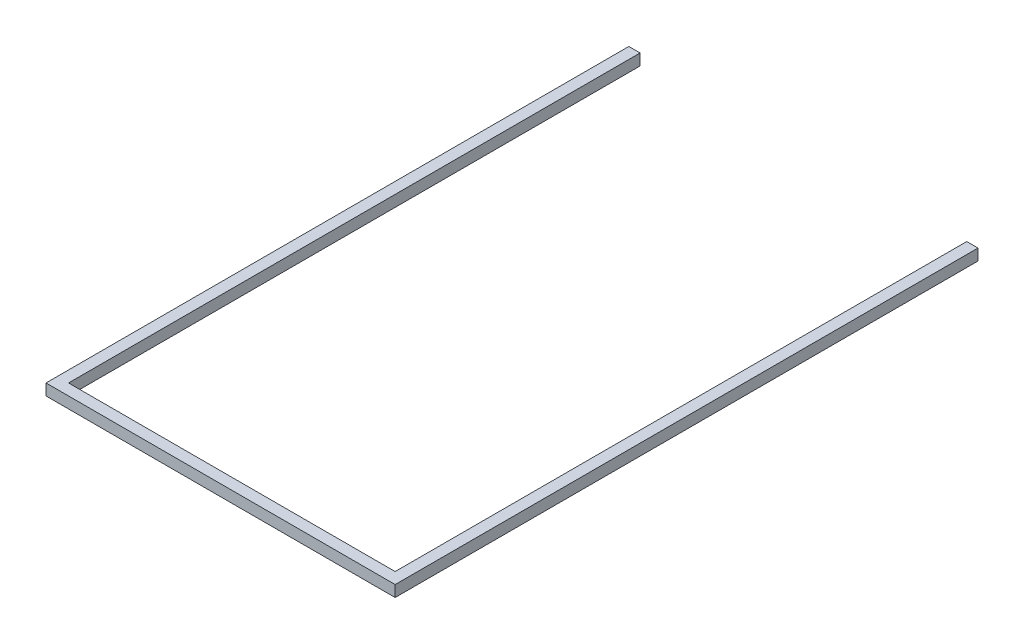
ISO-10303-21;
HEADER;
FILE_DESCRIPTION(('STEP AP214'),'2;1');
FILE_NAME('part.step','',(''),(''),'','','');
FILE_SCHEMA(('AUTOMOTIVE_DESIGN { 1 0 10303 214 1 1 1 1 }'));
ENDSEC;
DATA;
#1=APPLICATION_CONTEXT('core data for automotive mechanical design processes');
#2=APPLICATION_PROTOCOL_DEFINITION('international standard','automotive_design',2000,#1);
#3=PRODUCT_CONTEXT('',#1,'mechanical');
#4=PRODUCT('Part','Part','',(#3));
#5=PRODUCT_RELATED_PRODUCT_CATEGORY('part','',(#4));
#6=PRODUCT_DEFINITION_FORMATION('','',#4);
#7=PRODUCT_DEFINITION_CONTEXT('part definition',#1,'design');
#8=PRODUCT_DEFINITION('design','',#6,#7);
#9=PRODUCT_DEFINITION_SHAPE('','',#8);
#10=(LENGTH_UNIT() NAMED_UNIT(*) SI_UNIT(.MILLI.,.METRE.));
#11=(NAMED_UNIT(*) PLANE_ANGLE_UNIT() SI_UNIT($,.RADIAN.));
#12=(NAMED_UNIT(*) SI_UNIT($,.STERADIAN.) SOLID_ANGLE_UNIT());
#13=UNCERTAINTY_MEASURE_WITH_UNIT(LENGTH_MEASURE(1.E-05),#10,'distance_accuracy_value','');
#14=(GEOMETRIC_REPRESENTATION_CONTEXT(3) GLOBAL_UNCERTAINTY_ASSIGNED_CONTEXT((#13)) GLOBAL_UNIT_ASSIGNED_CONTEXT((#10,
#11,#12)) REPRESENTATION_CONTEXT('',''));
#15=CARTESIAN_POINT('',(0.,0.,0.));
#16=DIRECTION('',(0.,0.,1.));
#17=DIRECTION('',(1.,0.,0.));
#18=AXIS2_PLACEMENT_3D('',#15,#16,#17);
#19=CARTESIAN_POINT('',(-61.1442597325954,20.,-976.787813670094));
#20=DIRECTION('',(0.,0.,1.));
#21=DIRECTION('',(1.,0.,0.));
#22=AXIS2_PLACEMENT_3D('',#19,#20,#21);
#23=PLANE('',#22);
#24=DIRECTION('',(-1.,0.,0.));
#25=VECTOR('',#24,1.);
#26=CARTESIAN_POINT('',(-61.1442597325954,0.,-976.787813670094));
#27=LINE('',#26,#25);
#28=CARTESIAN_POINT('',(-61.1442597325954,0.,-976.787813670094));
#29=VERTEX_POINT('',#28);
#30=CARTESIAN_POINT('',(-81.1442597325955,0.,-976.787813670094));
#31=VERTEX_POINT('',#30);
#32=EDGE_CURVE('E129',#29,#31,#27,.T.);
#33=ORIENTED_EDGE('',*,*,#32,.T.);
#34=DIRECTION('',(0.,-1.,0.));
#35=VECTOR('',#34,1.);
#36=CARTESIAN_POINT('',(-81.1442597325955,20.,-976.787813670094));
#37=LINE('',#36,#35);
#38=CARTESIAN_POINT('',(-81.1442597325955,20.,-976.787813670094));
#39=VERTEX_POINT('',#38);
#40=EDGE_CURVE('E11',#39,#31,#37,.T.);
#41=ORIENTED_EDGE('',*,*,#40,.F.);
#42=DIRECTION('',(-1.,0.,0.));
#43=VECTOR('',#42,1.);
#44=CARTESIAN_POINT('',(-61.1442597325954,20.,-976.787813670094));
#45=LINE('',#44,#43);
#46=CARTESIAN_POINT('',(-61.1442597325954,20.,-976.787813670094));
#47=VERTEX_POINT('',#46);
#48=EDGE_CURVE('E143',#47,#39,#45,.T.);
#49=ORIENTED_EDGE('',*,*,#48,.F.);
#50=DIRECTION('',(0.,-1.,0.));
#51=VECTOR('',#50,1.);
#52=CARTESIAN_POINT('',(-61.1442597325954,20.,-976.787813670094));
#53=LINE('',#52,#51);
#54=EDGE_CURVE('E125',#47,#29,#53,.T.);
#55=ORIENTED_EDGE('',*,*,#54,.T.);
#56=EDGE_LOOP('',(#33,#41,#49,#55));
#57=FACE_BOUND('',#56,.T.);
#58=ADVANCED_FACE('F33',(#57),#23,.F.);
#59=CARTESIAN_POINT('',(-81.1442597325955,20.,-976.787813670094));
#60=DIRECTION('',(1.,0.,0.));
#61=DIRECTION('',(0.,0.,-1.));
#62=AXIS2_PLACEMENT_3D('',#59,#60,#61);
#63=PLANE('',#62);
#64=DIRECTION('',(0.,0.,1.));
#65=VECTOR('',#64,1.);
#66=CARTESIAN_POINT('',(-81.1442597325955,0.,-976.787813670094));
#67=LINE('',#66,#65);
#68=CARTESIAN_POINT('',(-81.1442597325954,0.,58.2121863299054));
#69=VERTEX_POINT('',#68);
#70=EDGE_CURVE('E132',#31,#69,#67,.T.);
#71=ORIENTED_EDGE('',*,*,#70,.T.);
#72=DIRECTION('',(0.,-1.,0.));
#73=VECTOR('',#72,1.);
#74=CARTESIAN_POINT('',(-81.1442597325954,20.,58.2121863299054));
#75=LINE('',#74,#73);
#76=CARTESIAN_POINT('',(-81.1442597325954,20.,58.2121863299054));
#77=VERTEX_POINT('',#76);
#78=EDGE_CURVE('E41',#77,#69,#75,.T.);
#79=ORIENTED_EDGE('',*,*,#78,.F.);
#80=DIRECTION('',(0.,0.,1.));
#81=VECTOR('',#80,1.);
#82=CARTESIAN_POINT('',(-81.1442597325955,20.,-976.787813670094));
#83=LINE('',#82,#81);
#84=EDGE_CURVE('E92',#39,#77,#83,.T.);
#85=ORIENTED_EDGE('',*,*,#84,.F.);
#86=ORIENTED_EDGE('',*,*,#40,.T.);
#87=EDGE_LOOP('',(#71,#79,#85,#86));
#88=FACE_BOUND('',#87,.T.);
#89=ADVANCED_FACE('F178',(#88),#63,.F.);
#90=CARTESIAN_POINT('',(-81.1442597325954,20.,58.2121863299054));
#91=DIRECTION('',(0.,0.,-1.));
#92=DIRECTION('',(-1.,0.,0.));
#93=AXIS2_PLACEMENT_3D('',#90,#91,#92);
#94=PLANE('',#93);
#95=DIRECTION('',(1.,0.,0.));
#96=VECTOR('',#95,1.);
#97=CARTESIAN_POINT('',(-81.1442597325954,0.,58.2121863299054));
#98=LINE('',#97,#96);
#99=CARTESIAN_POINT('',(538.855740267405,0.,58.2121863299054));
#100=VERTEX_POINT('',#99);
#101=EDGE_CURVE('E134',#69,#100,#98,.T.);
#102=ORIENTED_EDGE('',*,*,#101,.T.);
#103=DIRECTION('',(0.,-1.,0.));
#104=VECTOR('',#103,1.);
#105=CARTESIAN_POINT('',(538.855740267405,20.,58.2121863299054));
#106=LINE('',#105,#104);
#107=CARTESIAN_POINT('',(538.855740267405,20.,58.2121863299054));
#108=VERTEX_POINT('',#107);
#109=EDGE_CURVE('E150',#108,#100,#106,.T.);
#110=ORIENTED_EDGE('',*,*,#109,.F.);
#111=DIRECTION('',(1.,0.,0.));
#112=VECTOR('',#111,1.);
#113=CARTESIAN_POINT('',(-81.1442597325954,20.,58.2121863299054));
#114=LINE('',#113,#112);
#115=EDGE_CURVE('E158',#77,#108,#114,.T.);
#116=ORIENTED_EDGE('',*,*,#115,.F.);
#117=ORIENTED_EDGE('',*,*,#78,.T.);
#118=EDGE_LOOP('',(#102,#110,#116,#117));
#119=FACE_BOUND('',#118,.T.);
#120=ADVANCED_FACE('F156',(#119),#94,.F.);
#121=CARTESIAN_POINT('',(538.855740267405,20.,58.2121863299054));
#122=DIRECTION('',(-1.,0.,0.));
#123=DIRECTION('',(0.,0.,1.));
#124=AXIS2_PLACEMENT_3D('',#121,#122,#123);
#125=PLANE('',#124);
#126=DIRECTION('',(0.,0.,-1.));
#127=VECTOR('',#126,1.);
#128=CARTESIAN_POINT('',(538.855740267405,0.,58.2121863299054));
#129=LINE('',#128,#127);
#130=CARTESIAN_POINT('',(538.855740267405,0.,-976.787813670095));
#131=VERTEX_POINT('',#130);
#132=EDGE_CURVE('E136',#100,#131,#129,.T.);
#133=ORIENTED_EDGE('',*,*,#132,.T.);
#134=DIRECTION('',(0.,-1.,0.));
#135=VECTOR('',#134,1.);
#136=CARTESIAN_POINT('',(538.855740267405,20.,-976.787813670095));
#137=LINE('',#136,#135);
#138=CARTESIAN_POINT('',(538.855740267405,20.,-976.787813670095));
#139=VERTEX_POINT('',#138);
#140=EDGE_CURVE('E147',#139,#131,#137,.T.);
#141=ORIENTED_EDGE('',*,*,#140,.F.);
#142=DIRECTION('',(0.,0.,-1.));
#143=VECTOR('',#142,1.);
#144=CARTESIAN_POINT('',(538.855740267405,20.,58.2121863299054));
#145=LINE('',#144,#143);
#146=EDGE_CURVE('E170',#108,#139,#145,.T.);
#147=ORIENTED_EDGE('',*,*,#146,.F.);
#148=ORIENTED_EDGE('',*,*,#109,.T.);
#149=EDGE_LOOP('',(#133,#141,#147,#148));
#150=FACE_BOUND('',#149,.T.);
#151=ADVANCED_FACE('F166',(#150),#125,.F.);
#152=CARTESIAN_POINT('',(538.855740267405,20.,-976.787813670095));
#153=DIRECTION('',(0.,0.,1.));
#154=DIRECTION('',(1.,0.,0.));
#155=AXIS2_PLACEMENT_3D('',#152,#153,#154);
#156=PLANE('',#155);
#157=DIRECTION('',(-1.,0.,0.));
#158=VECTOR('',#157,1.);
#159=CARTESIAN_POINT('',(538.855740267405,0.,-976.787813670095));
#160=LINE('',#159,#158);
#161=CARTESIAN_POINT('',(518.855740267404,0.,-976.787813670095));
#162=VERTEX_POINT('',#161);
#163=EDGE_CURVE('E138',#131,#162,#160,.T.);
#164=ORIENTED_EDGE('',*,*,#163,.T.);
#165=DIRECTION('',(0.,-1.,0.));
#166=VECTOR('',#165,1.);
#167=CARTESIAN_POINT('',(518.855740267404,20.,-976.787813670095));
#168=LINE('',#167,#166);
#169=CARTESIAN_POINT('',(518.855740267404,20.,-976.787813670095));
#170=VERTEX_POINT('',#169);
#171=EDGE_CURVE('E120',#170,#162,#168,.T.);
#172=ORIENTED_EDGE('',*,*,#171,.F.);
#173=DIRECTION('',(-1.,0.,0.));
#174=VECTOR('',#173,1.);
#175=CARTESIAN_POINT('',(538.855740267405,20.,-976.787813670095));
#176=LINE('',#175,#174);
#177=EDGE_CURVE('E111',#139,#170,#176,.T.);
#178=ORIENTED_EDGE('',*,*,#177,.F.);
#179=ORIENTED_EDGE('',*,*,#140,.T.);
#180=EDGE_LOOP('',(#164,#172,#178,#179));
#181=FACE_BOUND('',#180,.T.);
#182=ADVANCED_FACE('F169',(#181),#156,.F.);
#183=CARTESIAN_POINT('',(518.855740267404,20.,-976.787813670095));
#184=DIRECTION('',(1.,0.,0.));
#185=DIRECTION('',(0.,0.,-1.));
#186=AXIS2_PLACEMENT_3D('',#183,#184,#185);
#187=PLANE('',#186);
#188=DIRECTION('',(0.,0.,1.));
#189=VECTOR('',#188,1.);
#190=CARTESIAN_POINT('',(518.855740267404,0.,-976.787813670095));
#191=LINE('',#190,#189);
#192=CARTESIAN_POINT('',(518.855740267405,0.,38.2121863299052));
#193=VERTEX_POINT('',#192);
#194=EDGE_CURVE('E119',#162,#193,#191,.T.);
#195=ORIENTED_EDGE('',*,*,#194,.T.);
#196=DIRECTION('',(0.,-1.,0.));
#197=VECTOR('',#196,1.);
#198=CARTESIAN_POINT('',(518.855740267405,20.,38.2121863299052));
#199=LINE('',#198,#197);
#200=CARTESIAN_POINT('',(518.855740267405,20.,38.2121863299052));
#201=VERTEX_POINT('',#200);
#202=EDGE_CURVE('E116',#201,#193,#199,.T.);
#203=ORIENTED_EDGE('',*,*,#202,.F.);
#204=DIRECTION('',(0.,0.,1.));
#205=VECTOR('',#204,1.);
#206=CARTESIAN_POINT('',(518.855740267404,20.,-976.787813670095));
#207=LINE('',#206,#205);
#208=EDGE_CURVE('E105',#170,#201,#207,.T.);
#209=ORIENTED_EDGE('',*,*,#208,.F.);
#210=ORIENTED_EDGE('',*,*,#171,.T.);
#211=EDGE_LOOP('',(#195,#203,#209,#210));
#212=FACE_BOUND('',#211,.T.);
#213=ADVANCED_FACE('F117',(#212),#187,.F.);
#214=CARTESIAN_POINT('',(518.855740267405,20.,38.2121863299052));
#215=DIRECTION('',(0.,0.,1.));
#216=DIRECTION('',(1.,0.,0.));
#217=AXIS2_PLACEMENT_3D('',#214,#215,#216);
#218=PLANE('',#217);
#219=DIRECTION('',(-1.,0.,0.));
#220=VECTOR('',#219,1.);
#221=CARTESIAN_POINT('',(518.855740267405,0.,38.2121863299052));
#222=LINE('',#221,#220);
#223=CARTESIAN_POINT('',(-61.1442597325954,0.,38.2121863299054));
#224=VERTEX_POINT('',#223);
#225=EDGE_CURVE('E78',#193,#224,#222,.T.);
#226=ORIENTED_EDGE('',*,*,#225,.T.);
#227=DIRECTION('',(0.,-1.,0.));
#228=VECTOR('',#227,1.);
#229=CARTESIAN_POINT('',(-61.1442597325954,20.,38.2121863299054));
#230=LINE('',#229,#228);
#231=CARTESIAN_POINT('',(-61.1442597325954,20.,38.2121863299054));
#232=VERTEX_POINT('',#231);
#233=EDGE_CURVE('E121',#232,#224,#230,.T.);
#234=ORIENTED_EDGE('',*,*,#233,.F.);
#235=DIRECTION('',(-1.,0.,0.));
#236=VECTOR('',#235,1.);
#237=CARTESIAN_POINT('',(518.855740267405,20.,38.2121863299052));
#238=LINE('',#237,#236);
#239=EDGE_CURVE('E109',#201,#232,#238,.T.);
#240=ORIENTED_EDGE('',*,*,#239,.F.);
#241=ORIENTED_EDGE('',*,*,#202,.T.);
#242=EDGE_LOOP('',(#226,#234,#240,#241));
#243=FACE_BOUND('',#242,.T.);
#244=ADVANCED_FACE('F123',(#243),#218,.F.);
#245=CARTESIAN_POINT('',(-61.1442597325954,20.,38.2121863299054));
#246=DIRECTION('',(-1.,0.,0.));
#247=DIRECTION('',(0.,0.,1.));
#248=AXIS2_PLACEMENT_3D('',#245,#246,#247);
#249=PLANE('',#248);
#250=DIRECTION('',(0.,0.,-1.));
#251=VECTOR('',#250,1.);
#252=CARTESIAN_POINT('',(-61.1442597325954,0.,38.2121863299054));
#253=LINE('',#252,#251);
#254=EDGE_CURVE('E84',#224,#29,#253,.T.);
#255=ORIENTED_EDGE('',*,*,#254,.T.);
#256=ORIENTED_EDGE('',*,*,#54,.F.);
#257=DIRECTION('',(0.,0.,-1.));
#258=VECTOR('',#257,1.);
#259=CARTESIAN_POINT('',(-61.1442597325954,20.,38.2121863299054));
#260=LINE('',#259,#258);
#261=EDGE_CURVE('E49',#232,#47,#260,.T.);
#262=ORIENTED_EDGE('',*,*,#261,.F.);
#263=ORIENTED_EDGE('',*,*,#233,.T.);
#264=EDGE_LOOP('',(#255,#256,#262,#263));
#265=FACE_BOUND('',#264,.T.);
#266=ADVANCED_FACE('F194',(#265),#249,.F.);
#267=CARTESIAN_POINT('',(0.,20.,0.));
#268=DIRECTION('',(0.,1.,0.));
#269=DIRECTION('',(0.,0.,1.));
#270=AXIS2_PLACEMENT_3D('',#267,#268,#269);
#271=PLANE('',#270);
#272=ORIENTED_EDGE('',*,*,#48,.T.);
#273=ORIENTED_EDGE('',*,*,#84,.T.);
#274=ORIENTED_EDGE('',*,*,#115,.T.);
#275=ORIENTED_EDGE('',*,*,#146,.T.);
#276=ORIENTED_EDGE('',*,*,#177,.T.);
#277=ORIENTED_EDGE('',*,*,#208,.T.);
#278=ORIENTED_EDGE('',*,*,#239,.T.);
#279=ORIENTED_EDGE('',*,*,#261,.T.);
#280=EDGE_LOOP('',(#272,#273,#274,#275,#276,#277,#278,#279));
#281=FACE_BOUND('',#280,.T.);
#282=ADVANCED_FACE('F107',(#281),#271,.T.);
#283=CARTESIAN_POINT('',(0.,0.,0.));
#284=DIRECTION('',(0.,1.,0.));
#285=DIRECTION('',(0.,0.,1.));
#286=AXIS2_PLACEMENT_3D('',#283,#284,#285);
#287=PLANE('',#286);
#288=ORIENTED_EDGE('',*,*,#32,.F.);
#289=ORIENTED_EDGE('',*,*,#254,.F.);
#290=ORIENTED_EDGE('',*,*,#225,.F.);
#291=ORIENTED_EDGE('',*,*,#194,.F.);
#292=ORIENTED_EDGE('',*,*,#163,.F.);
#293=ORIENTED_EDGE('',*,*,#132,.F.);
#294=ORIENTED_EDGE('',*,*,#101,.F.);
#295=ORIENTED_EDGE('',*,*,#70,.F.);
#296=EDGE_LOOP('',(#288,#289,#290,#291,#292,#293,#294,#295));
#297=FACE_BOUND('',#296,.T.);
#298=ADVANCED_FACE('F162',(#297),#287,.F.);
#299=CLOSED_SHELL('',(#58,#89,#120,#151,#182,#213,#244,#266,#282,#298));
#300=MANIFOLD_SOLID_BREP('B2',#299);
#301=ADVANCED_BREP_SHAPE_REPRESENTATION('',(#18,#300),#14);
#302=SHAPE_DEFINITION_REPRESENTATION(#9,#301);
ENDSEC;
END-ISO-10303-21;
